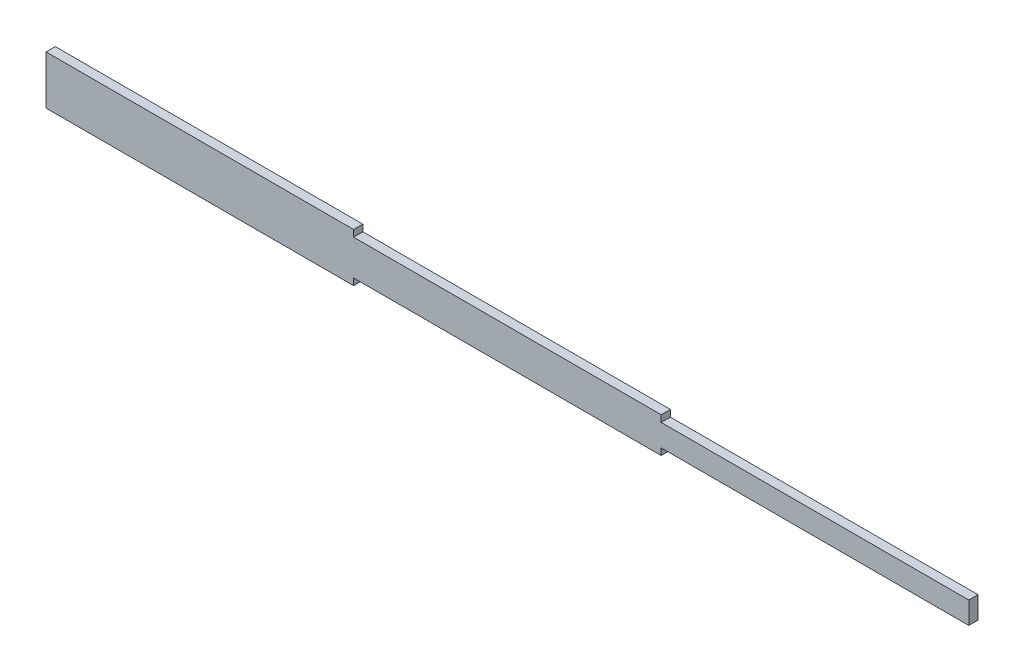
ISO-10303-21;
HEADER;
FILE_DESCRIPTION(('STEP AP214'),'2;1');
FILE_NAME('part.step','',(''),(''),'','','');
FILE_SCHEMA(('AUTOMOTIVE_DESIGN { 1 0 10303 214 1 1 1 1 }'));
ENDSEC;
DATA;
#1=APPLICATION_CONTEXT('core data for automotive mechanical design processes');
#2=APPLICATION_PROTOCOL_DEFINITION('international standard','automotive_design',2000,#1);
#3=PRODUCT_CONTEXT('',#1,'mechanical');
#4=PRODUCT('Part','Part','',(#3));
#5=PRODUCT_RELATED_PRODUCT_CATEGORY('part','',(#4));
#6=PRODUCT_DEFINITION_FORMATION('','',#4);
#7=PRODUCT_DEFINITION_CONTEXT('part definition',#1,'design');
#8=PRODUCT_DEFINITION('design','',#6,#7);
#9=PRODUCT_DEFINITION_SHAPE('','',#8);
#10=(LENGTH_UNIT() NAMED_UNIT(*) SI_UNIT(.MILLI.,.METRE.));
#11=(NAMED_UNIT(*) PLANE_ANGLE_UNIT() SI_UNIT($,.RADIAN.));
#12=(NAMED_UNIT(*) SI_UNIT($,.STERADIAN.) SOLID_ANGLE_UNIT());
#13=UNCERTAINTY_MEASURE_WITH_UNIT(LENGTH_MEASURE(1.E-05),#10,'distance_accuracy_value','');
#14=(GEOMETRIC_REPRESENTATION_CONTEXT(3) GLOBAL_UNCERTAINTY_ASSIGNED_CONTEXT((#13)) GLOBAL_UNIT_ASSIGNED_CONTEXT((#10,
#11,#12)) REPRESENTATION_CONTEXT('',''));
#15=CARTESIAN_POINT('',(0.,0.,0.));
#16=DIRECTION('',(0.,0.,1.));
#17=DIRECTION('',(1.,0.,0.));
#18=AXIS2_PLACEMENT_3D('',#15,#16,#17);
#19=CARTESIAN_POINT('',(1996.,0.,0.));
#20=DIRECTION('',(-1.,0.,0.));
#21=DIRECTION('',(0.,0.,1.));
#22=AXIS2_PLACEMENT_3D('',#19,#20,#21);
#23=PLANE('',#22);
#24=DIRECTION('',(0.,0.,-1.));
#25=VECTOR('',#24,1.);
#26=CARTESIAN_POINT('',(1996.,33.825,-13.));
#27=LINE('',#26,#25);
#28=CARTESIAN_POINT('',(1996.,33.825,13.));
#29=VERTEX_POINT('',#28);
#30=CARTESIAN_POINT('',(1996.,33.825,-13.));
#31=VERTEX_POINT('',#30);
#32=EDGE_CURVE('E236',#29,#31,#27,.T.);
#33=ORIENTED_EDGE('',*,*,#32,.F.);
#34=DIRECTION('',(0.,1.,0.));
#35=VECTOR('',#34,1.);
#36=CARTESIAN_POINT('',(1996.,-55.475,13.));
#37=LINE('',#36,#35);
#38=CARTESIAN_POINT('',(1996.,55.475,13.));
#39=VERTEX_POINT('',#38);
#40=EDGE_CURVE('E214',#29,#39,#37,.T.);
#41=ORIENTED_EDGE('',*,*,#40,.T.);
#42=DIRECTION('',(0.,0.,-1.));
#43=VECTOR('',#42,1.);
#44=CARTESIAN_POINT('',(1996.,55.475,13.));
#45=LINE('',#44,#43);
#46=CARTESIAN_POINT('',(1996.,55.475,-13.));
#47=VERTEX_POINT('',#46);
#48=EDGE_CURVE('E266',#39,#47,#45,.T.);
#49=ORIENTED_EDGE('',*,*,#48,.T.);
#50=DIRECTION('',(0.,-1.,0.));
#51=VECTOR('',#50,1.);
#52=CARTESIAN_POINT('',(1996.,-55.475,-13.));
#53=LINE('',#52,#51);
#54=EDGE_CURVE('E253',#47,#31,#53,.T.);
#55=ORIENTED_EDGE('',*,*,#54,.T.);
#56=EDGE_LOOP('',(#33,#41,#49,#55));
#57=FACE_BOUND('',#56,.T.);
#58=ADVANCED_FACE('F43',(#57),#23,.T.);
#59=CARTESIAN_POINT('',(998.,0.,0.));
#60=DIRECTION('',(1.,0.,0.));
#61=DIRECTION('',(0.,0.,-1.));
#62=AXIS2_PLACEMENT_3D('',#59,#60,#61);
#63=PLANE('',#62);
#64=DIRECTION('',(0.,0.,1.));
#65=VECTOR('',#64,1.);
#66=CARTESIAN_POINT('',(998.,-55.475,13.));
#67=LINE('',#66,#65);
#68=CARTESIAN_POINT('',(998.,-55.475,-13.));
#69=VERTEX_POINT('',#68);
#70=CARTESIAN_POINT('',(998.,-55.475,13.));
#71=VERTEX_POINT('',#70);
#72=EDGE_CURVE('E248',#69,#71,#67,.T.);
#73=ORIENTED_EDGE('',*,*,#72,.F.);
#74=DIRECTION('',(0.,-1.,0.));
#75=VECTOR('',#74,1.);
#76=CARTESIAN_POINT('',(998.,-77.125,-13.));
#77=LINE('',#76,#75);
#78=CARTESIAN_POINT('',(998.,-77.125,-13.));
#79=VERTEX_POINT('',#78);
#80=EDGE_CURVE('E297',#69,#79,#77,.T.);
#81=ORIENTED_EDGE('',*,*,#80,.T.);
#82=DIRECTION('',(0.,0.,1.));
#83=VECTOR('',#82,1.);
#84=CARTESIAN_POINT('',(998.,-77.125,-13.));
#85=LINE('',#84,#83);
#86=CARTESIAN_POINT('',(998.,-77.125,13.));
#87=VERTEX_POINT('',#86);
#88=EDGE_CURVE('E302',#79,#87,#85,.T.);
#89=ORIENTED_EDGE('',*,*,#88,.T.);
#90=DIRECTION('',(0.,1.,0.));
#91=VECTOR('',#90,1.);
#92=CARTESIAN_POINT('',(998.,-77.125,13.));
#93=LINE('',#92,#91);
#94=EDGE_CURVE('E288',#87,#71,#93,.T.);
#95=ORIENTED_EDGE('',*,*,#94,.T.);
#96=EDGE_LOOP('',(#73,#81,#89,#95));
#97=FACE_BOUND('',#96,.T.);
#98=ADVANCED_FACE('F507',(#97),#63,.F.);
#99=DIRECTION('',(0.,0.,-1.));
#100=VECTOR('',#99,1.);
#101=CARTESIAN_POINT('',(998.,55.475,13.));
#102=LINE('',#101,#100);
#103=CARTESIAN_POINT('',(998.,55.475,13.));
#104=VERTEX_POINT('',#103);
#105=CARTESIAN_POINT('',(998.,55.475,-13.));
#106=VERTEX_POINT('',#105);
#107=EDGE_CURVE('E274',#104,#106,#102,.T.);
#108=ORIENTED_EDGE('',*,*,#107,.F.);
#109=CARTESIAN_POINT('',(998.,77.125,13.));
#110=VERTEX_POINT('',#109);
#111=EDGE_CURVE('E293',#104,#110,#93,.T.);
#112=ORIENTED_EDGE('',*,*,#111,.T.);
#113=DIRECTION('',(0.,0.,-1.));
#114=VECTOR('',#113,1.);
#115=CARTESIAN_POINT('',(998.,77.125,-13.));
#116=LINE('',#115,#114);
#117=CARTESIAN_POINT('',(998.,77.125,-13.));
#118=VERTEX_POINT('',#117);
#119=EDGE_CURVE('E292',#110,#118,#116,.T.);
#120=ORIENTED_EDGE('',*,*,#119,.T.);
#121=EDGE_CURVE('E298',#118,#106,#77,.T.);
#122=ORIENTED_EDGE('',*,*,#121,.T.);
#123=EDGE_LOOP('',(#108,#112,#120,#122));
#124=FACE_BOUND('',#123,.T.);
#125=ADVANCED_FACE('F512',(#124),#63,.F.);
#126=CARTESIAN_POINT('',(2000.,0.,0.));
#127=DIRECTION('',(-1.,0.,0.));
#128=DIRECTION('',(0.,0.,1.));
#129=AXIS2_PLACEMENT_3D('',#126,#127,#128);
#130=PLANE('',#129);
#131=DIRECTION('',(0.,0.,-1.));
#132=VECTOR('',#131,1.);
#133=CARTESIAN_POINT('',(2000.,-35.825,15.));
#134=LINE('',#133,#132);
#135=CARTESIAN_POINT('',(2000.,-35.825,15.));
#136=VERTEX_POINT('',#135);
#137=CARTESIAN_POINT('',(2000.,-35.825,-15.));
#138=VERTEX_POINT('',#137);
#139=EDGE_CURVE('E339',#136,#138,#134,.T.);
#140=ORIENTED_EDGE('',*,*,#139,.F.);
#141=DIRECTION('',(0.,-1.,0.));
#142=VECTOR('',#141,1.);
#143=CARTESIAN_POINT('',(2000.,-57.475,15.));
#144=LINE('',#143,#142);
#145=CARTESIAN_POINT('',(2000.,-57.475,15.));
#146=VERTEX_POINT('',#145);
#147=EDGE_CURVE('E378',#136,#146,#144,.T.);
#148=ORIENTED_EDGE('',*,*,#147,.T.);
#149=DIRECTION('',(0.,0.,-1.));
#150=VECTOR('',#149,1.);
#151=CARTESIAN_POINT('',(2000.,-57.475,15.));
#152=LINE('',#151,#150);
#153=CARTESIAN_POINT('',(2000.,-57.475,-15.));
#154=VERTEX_POINT('',#153);
#155=EDGE_CURVE('E382',#146,#154,#152,.T.);
#156=ORIENTED_EDGE('',*,*,#155,.T.);
#157=DIRECTION('',(0.,1.,0.));
#158=VECTOR('',#157,1.);
#159=CARTESIAN_POINT('',(2000.,-57.475,-15.));
#160=LINE('',#159,#158);
#161=EDGE_CURVE('E371',#154,#138,#160,.T.);
#162=ORIENTED_EDGE('',*,*,#161,.T.);
#163=EDGE_LOOP('',(#140,#148,#156,#162));
#164=FACE_BOUND('',#163,.T.);
#165=ADVANCED_FACE('F545',(#164),#130,.F.);
#166=DIRECTION('',(0.,0.,1.));
#167=VECTOR('',#166,1.);
#168=CARTESIAN_POINT('',(2000.,35.825,15.));
#169=LINE('',#168,#167);
#170=CARTESIAN_POINT('',(2000.,35.825,-15.));
#171=VERTEX_POINT('',#170);
#172=CARTESIAN_POINT('',(2000.,35.825,15.));
#173=VERTEX_POINT('',#172);
#174=EDGE_CURVE('E324',#171,#173,#169,.T.);
#175=ORIENTED_EDGE('',*,*,#174,.F.);
#176=CARTESIAN_POINT('',(2000.,57.475,-15.));
#177=VERTEX_POINT('',#176);
#178=EDGE_CURVE('E375',#171,#177,#160,.T.);
#179=ORIENTED_EDGE('',*,*,#178,.T.);
#180=DIRECTION('',(0.,0.,1.));
#181=VECTOR('',#180,1.);
#182=CARTESIAN_POINT('',(2000.,57.475,15.));
#183=LINE('',#182,#181);
#184=CARTESIAN_POINT('',(2000.,57.475,15.));
#185=VERTEX_POINT('',#184);
#186=EDGE_CURVE('E374',#177,#185,#183,.T.);
#187=ORIENTED_EDGE('',*,*,#186,.T.);
#188=EDGE_CURVE('E379',#185,#173,#144,.T.);
#189=ORIENTED_EDGE('',*,*,#188,.T.);
#190=EDGE_LOOP('',(#175,#179,#187,#189));
#191=FACE_BOUND('',#190,.T.);
#192=ADVANCED_FACE('F548',(#191),#130,.F.);
#193=CARTESIAN_POINT('',(1000.,0.,0.));
#194=DIRECTION('',(-1.,0.,0.));
#195=DIRECTION('',(0.,0.,1.));
#196=AXIS2_PLACEMENT_3D('',#193,#194,#195);
#197=PLANE('',#196);
#198=DIRECTION('',(0.,0.,-1.));
#199=VECTOR('',#198,1.);
#200=CARTESIAN_POINT('',(1000.,-57.475,15.));
#201=LINE('',#200,#199);
#202=CARTESIAN_POINT('',(1000.,-57.475,15.));
#203=VERTEX_POINT('',#202);
#204=CARTESIAN_POINT('',(1000.,-57.475,-15.));
#205=VERTEX_POINT('',#204);
#206=EDGE_CURVE('E389',#203,#205,#201,.T.);
#207=ORIENTED_EDGE('',*,*,#206,.F.);
#208=DIRECTION('',(0.,-1.,0.));
#209=VECTOR('',#208,1.);
#210=CARTESIAN_POINT('',(1000.,-79.125,15.));
#211=LINE('',#210,#209);
#212=CARTESIAN_POINT('',(1000.,-79.125,15.));
#213=VERTEX_POINT('',#212);
#214=EDGE_CURVE('E416',#203,#213,#211,.T.);
#215=ORIENTED_EDGE('',*,*,#214,.T.);
#216=DIRECTION('',(0.,0.,-1.));
#217=VECTOR('',#216,1.);
#218=CARTESIAN_POINT('',(1000.,-79.125,15.));
#219=LINE('',#218,#217);
#220=CARTESIAN_POINT('',(1000.,-79.125,-15.));
#221=VERTEX_POINT('',#220);
#222=EDGE_CURVE('E420',#213,#221,#219,.T.);
#223=ORIENTED_EDGE('',*,*,#222,.T.);
#224=DIRECTION('',(0.,1.,0.));
#225=VECTOR('',#224,1.);
#226=CARTESIAN_POINT('',(1000.,-79.125,-15.));
#227=LINE('',#226,#225);
#228=EDGE_CURVE('E409',#221,#205,#227,.T.);
#229=ORIENTED_EDGE('',*,*,#228,.T.);
#230=EDGE_LOOP('',(#207,#215,#223,#229));
#231=FACE_BOUND('',#230,.T.);
#232=ADVANCED_FACE('F466',(#231),#197,.F.);
#233=DIRECTION('',(0.,0.,1.));
#234=VECTOR('',#233,1.);
#235=CARTESIAN_POINT('',(1000.,57.475,15.));
#236=LINE('',#235,#234);
#237=CARTESIAN_POINT('',(1000.,57.475,-15.));
#238=VERTEX_POINT('',#237);
#239=CARTESIAN_POINT('',(1000.,57.475,15.));
#240=VERTEX_POINT('',#239);
#241=EDGE_CURVE('E370',#238,#240,#236,.T.);
#242=ORIENTED_EDGE('',*,*,#241,.F.);
#243=CARTESIAN_POINT('',(1000.,79.125,-15.));
#244=VERTEX_POINT('',#243);
#245=EDGE_CURVE('E413',#238,#244,#227,.T.);
#246=ORIENTED_EDGE('',*,*,#245,.T.);
#247=DIRECTION('',(0.,0.,1.));
#248=VECTOR('',#247,1.);
#249=CARTESIAN_POINT('',(1000.,79.125,15.));
#250=LINE('',#249,#248);
#251=CARTESIAN_POINT('',(1000.,79.125,15.));
#252=VERTEX_POINT('',#251);
#253=EDGE_CURVE('E412',#244,#252,#250,.T.);
#254=ORIENTED_EDGE('',*,*,#253,.T.);
#255=EDGE_CURVE('E417',#252,#240,#211,.T.);
#256=ORIENTED_EDGE('',*,*,#255,.T.);
#257=EDGE_LOOP('',(#242,#246,#254,#256));
#258=FACE_BOUND('',#257,.T.);
#259=ADVANCED_FACE('F558',(#258),#197,.F.);
#260=CARTESIAN_POINT('',(1000.,-79.125,-15.));
#261=DIRECTION('',(0.,0.,1.));
#262=DIRECTION('',(1.,0.,0.));
#263=AXIS2_PLACEMENT_3D('',#260,#261,#262);
#264=PLANE('',#263);
#265=DIRECTION('',(0.,1.,0.));
#266=VECTOR('',#265,1.);
#267=CARTESIAN_POINT('',(0.,-79.125,-15.));
#268=LINE('',#267,#266);
#269=CARTESIAN_POINT('',(0.,-79.125,-15.));
#270=VERTEX_POINT('',#269);
#271=CARTESIAN_POINT('',(0.,79.125,-15.));
#272=VERTEX_POINT('',#271);
#273=EDGE_CURVE('E408',#270,#272,#268,.T.);
#274=ORIENTED_EDGE('',*,*,#273,.T.);
#275=DIRECTION('',(-1.,0.,0.));
#276=VECTOR('',#275,1.);
#277=CARTESIAN_POINT('',(1000.,79.125,-15.));
#278=LINE('',#277,#276);
#279=EDGE_CURVE('E11',#244,#272,#278,.T.);
#280=ORIENTED_EDGE('',*,*,#279,.F.);
#281=ORIENTED_EDGE('',*,*,#245,.F.);
#282=DIRECTION('',(-1.,0.,0.));
#283=VECTOR('',#282,1.);
#284=CARTESIAN_POINT('',(2000.,57.475,-15.));
#285=LINE('',#284,#283);
#286=EDGE_CURVE('E404',#177,#238,#285,.T.);
#287=ORIENTED_EDGE('',*,*,#286,.F.);
#288=ORIENTED_EDGE('',*,*,#178,.F.);
#289=DIRECTION('',(-1.,0.,0.));
#290=VECTOR('',#289,1.);
#291=CARTESIAN_POINT('',(3000.,35.825,-15.));
#292=LINE('',#291,#290);
#293=CARTESIAN_POINT('',(3000.,35.825,-15.));
#294=VERTEX_POINT('',#293);
#295=EDGE_CURVE('E366',#294,#171,#292,.T.);
#296=ORIENTED_EDGE('',*,*,#295,.F.);
#297=DIRECTION('',(0.,1.,0.));
#298=VECTOR('',#297,1.);
#299=CARTESIAN_POINT('',(3000.,-35.825,-15.));
#300=LINE('',#299,#298);
#301=CARTESIAN_POINT('',(3000.,-35.825,-15.));
#302=VERTEX_POINT('',#301);
#303=EDGE_CURVE('E334',#302,#294,#300,.T.);
#304=ORIENTED_EDGE('',*,*,#303,.F.);
#305=DIRECTION('',(-1.,0.,0.));
#306=VECTOR('',#305,1.);
#307=CARTESIAN_POINT('',(3000.,-35.825,-15.));
#308=LINE('',#307,#306);
#309=EDGE_CURVE('E348',#302,#138,#308,.T.);
#310=ORIENTED_EDGE('',*,*,#309,.T.);
#311=ORIENTED_EDGE('',*,*,#161,.F.);
#312=DIRECTION('',(-1.,0.,0.));
#313=VECTOR('',#312,1.);
#314=CARTESIAN_POINT('',(2000.,-57.475,-15.));
#315=LINE('',#314,#313);
#316=EDGE_CURVE('E385',#154,#205,#315,.T.);
#317=ORIENTED_EDGE('',*,*,#316,.T.);
#318=ORIENTED_EDGE('',*,*,#228,.F.);
#319=DIRECTION('',(-1.,0.,0.));
#320=VECTOR('',#319,1.);
#321=CARTESIAN_POINT('',(1000.,-79.125,-15.));
#322=LINE('',#321,#320);
#323=EDGE_CURVE('E423',#221,#270,#322,.T.);
#324=ORIENTED_EDGE('',*,*,#323,.T.);
#325=EDGE_LOOP('',(#274,#280,#281,#287,#288,#296,#304,#310,#311,#317,#318,#324));
#326=FACE_BOUND('',#325,.T.);
#327=ADVANCED_FACE('F45',(#326),#264,.F.);
#328=CARTESIAN_POINT('',(1000.,79.125,15.));
#329=DIRECTION('',(0.,-1.,0.));
#330=DIRECTION('',(0.,0.,-1.));
#331=AXIS2_PLACEMENT_3D('',#328,#329,#330);
#332=PLANE('',#331);
#333=DIRECTION('',(0.,0.,1.));
#334=VECTOR('',#333,1.);
#335=CARTESIAN_POINT('',(0.,79.125,15.));
#336=LINE('',#335,#334);
#337=CARTESIAN_POINT('',(0.,79.125,15.));
#338=VERTEX_POINT('',#337);
#339=EDGE_CURVE('E427',#272,#338,#336,.T.);
#340=ORIENTED_EDGE('',*,*,#339,.T.);
#341=DIRECTION('',(-1.,0.,0.));
#342=VECTOR('',#341,1.);
#343=CARTESIAN_POINT('',(1000.,79.125,15.));
#344=LINE('',#343,#342);
#345=EDGE_CURVE('E52',#252,#338,#344,.T.);
#346=ORIENTED_EDGE('',*,*,#345,.F.);
#347=ORIENTED_EDGE('',*,*,#253,.F.);
#348=ORIENTED_EDGE('',*,*,#279,.T.);
#349=EDGE_LOOP('',(#340,#346,#347,#348));
#350=FACE_BOUND('',#349,.T.);
#351=ADVANCED_FACE('F565',(#350),#332,.F.);
#352=CARTESIAN_POINT('',(1000.,-79.125,15.));
#353=DIRECTION('',(0.,0.,-1.));
#354=DIRECTION('',(-1.,0.,0.));
#355=AXIS2_PLACEMENT_3D('',#352,#353,#354);
#356=PLANE('',#355);
#357=DIRECTION('',(0.,-1.,0.));
#358=VECTOR('',#357,1.);
#359=CARTESIAN_POINT('',(0.,-79.125,15.));
#360=LINE('',#359,#358);
#361=CARTESIAN_POINT('',(0.,-79.125,15.));
#362=VERTEX_POINT('',#361);
#363=EDGE_CURVE('E430',#338,#362,#360,.T.);
#364=ORIENTED_EDGE('',*,*,#363,.T.);
#365=DIRECTION('',(-1.,0.,0.));
#366=VECTOR('',#365,1.);
#367=CARTESIAN_POINT('',(1000.,-79.125,15.));
#368=LINE('',#367,#366);
#369=EDGE_CURVE('E439',#213,#362,#368,.T.);
#370=ORIENTED_EDGE('',*,*,#369,.F.);
#371=ORIENTED_EDGE('',*,*,#214,.F.);
#372=DIRECTION('',(-1.,0.,0.));
#373=VECTOR('',#372,1.);
#374=CARTESIAN_POINT('',(2000.,-57.475,15.));
#375=LINE('',#374,#373);
#376=EDGE_CURVE('E396',#146,#203,#375,.T.);
#377=ORIENTED_EDGE('',*,*,#376,.F.);
#378=ORIENTED_EDGE('',*,*,#147,.F.);
#379=DIRECTION('',(-1.,0.,0.));
#380=VECTOR('',#379,1.);
#381=CARTESIAN_POINT('',(3000.,-35.825,15.));
#382=LINE('',#381,#380);
#383=CARTESIAN_POINT('',(3000.,-35.825,15.));
#384=VERTEX_POINT('',#383);
#385=EDGE_CURVE('E358',#384,#136,#382,.T.);
#386=ORIENTED_EDGE('',*,*,#385,.F.);
#387=DIRECTION('',(0.,-1.,0.));
#388=VECTOR('',#387,1.);
#389=CARTESIAN_POINT('',(3000.,-35.825,15.));
#390=LINE('',#389,#388);
#391=CARTESIAN_POINT('',(3000.,35.825,15.));
#392=VERTEX_POINT('',#391);
#393=EDGE_CURVE('E342',#392,#384,#390,.T.);
#394=ORIENTED_EDGE('',*,*,#393,.F.);
#395=DIRECTION('',(-1.,0.,0.));
#396=VECTOR('',#395,1.);
#397=CARTESIAN_POINT('',(3000.,35.825,15.));
#398=LINE('',#397,#396);
#399=EDGE_CURVE('E362',#392,#173,#398,.T.);
#400=ORIENTED_EDGE('',*,*,#399,.T.);
#401=ORIENTED_EDGE('',*,*,#188,.F.);
#402=DIRECTION('',(-1.,0.,0.));
#403=VECTOR('',#402,1.);
#404=CARTESIAN_POINT('',(2000.,57.475,15.));
#405=LINE('',#404,#403);
#406=EDGE_CURVE('E400',#185,#240,#405,.T.);
#407=ORIENTED_EDGE('',*,*,#406,.T.);
#408=ORIENTED_EDGE('',*,*,#255,.F.);
#409=ORIENTED_EDGE('',*,*,#345,.T.);
#410=EDGE_LOOP('',(#364,#370,#371,#377,#378,#386,#394,#400,#401,#407,#408,#409));
#411=FACE_BOUND('',#410,.T.);
#412=ADVANCED_FACE('F448',(#411),#356,.F.);
#413=CARTESIAN_POINT('',(1000.,-79.125,15.));
#414=DIRECTION('',(0.,1.,0.));
#415=DIRECTION('',(0.,0.,1.));
#416=AXIS2_PLACEMENT_3D('',#413,#414,#415);
#417=PLANE('',#416);
#418=DIRECTION('',(0.,0.,-1.));
#419=VECTOR('',#418,1.);
#420=CARTESIAN_POINT('',(0.,-79.125,15.));
#421=LINE('',#420,#419);
#422=EDGE_CURVE('E433',#362,#270,#421,.T.);
#423=ORIENTED_EDGE('',*,*,#422,.T.);
#424=ORIENTED_EDGE('',*,*,#323,.F.);
#425=ORIENTED_EDGE('',*,*,#222,.F.);
#426=ORIENTED_EDGE('',*,*,#369,.T.);
#427=EDGE_LOOP('',(#423,#424,#425,#426));
#428=FACE_BOUND('',#427,.T.);
#429=ADVANCED_FACE('F458',(#428),#417,.F.);
#430=CARTESIAN_POINT('',(0.,0.,0.));
#431=DIRECTION('',(-1.,0.,0.));
#432=DIRECTION('',(0.,0.,1.));
#433=AXIS2_PLACEMENT_3D('',#430,#431,#432);
#434=PLANE('',#433);
#435=DIRECTION('',(0.,1.,0.));
#436=VECTOR('',#435,1.);
#437=CARTESIAN_POINT('',(0.,-77.125,13.));
#438=LINE('',#437,#436);
#439=CARTESIAN_POINT('',(0.,-77.125,13.));
#440=VERTEX_POINT('',#439);
#441=CARTESIAN_POINT('',(0.,77.125,13.));
#442=VERTEX_POINT('',#441);
#443=EDGE_CURVE('E280',#440,#442,#438,.T.);
#444=ORIENTED_EDGE('',*,*,#443,.F.);
#445=DIRECTION('',(0.,0.,1.));
#446=VECTOR('',#445,1.);
#447=CARTESIAN_POINT('',(0.,-77.125,-13.));
#448=LINE('',#447,#446);
#449=CARTESIAN_POINT('',(0.,-77.125,-13.));
#450=VERTEX_POINT('',#449);
#451=EDGE_CURVE('E317',#450,#440,#448,.T.);
#452=ORIENTED_EDGE('',*,*,#451,.F.);
#453=DIRECTION('',(0.,-1.,0.));
#454=VECTOR('',#453,1.);
#455=CARTESIAN_POINT('',(0.,-77.125,-13.));
#456=LINE('',#455,#454);
#457=CARTESIAN_POINT('',(0.,77.125,-13.));
#458=VERTEX_POINT('',#457);
#459=EDGE_CURVE('E313',#458,#450,#456,.T.);
#460=ORIENTED_EDGE('',*,*,#459,.F.);
#461=DIRECTION('',(0.,0.,-1.));
#462=VECTOR('',#461,1.);
#463=CARTESIAN_POINT('',(0.,77.125,-13.));
#464=LINE('',#463,#462);
#465=EDGE_CURVE('E309',#442,#458,#464,.T.);
#466=ORIENTED_EDGE('',*,*,#465,.F.);
#467=EDGE_LOOP('',(#444,#452,#460,#466));
#468=FACE_BOUND('',#467,.T.);
#469=ORIENTED_EDGE('',*,*,#273,.F.);
#470=ORIENTED_EDGE('',*,*,#422,.F.);
#471=ORIENTED_EDGE('',*,*,#363,.F.);
#472=ORIENTED_EDGE('',*,*,#339,.F.);
#473=EDGE_LOOP('',(#469,#470,#471,#472));
#474=FACE_BOUND('',#473,.T.);
#475=ADVANCED_FACE('F455',(#468,#474),#434,.T.);
#476=CARTESIAN_POINT('',(2000.,57.475,15.));
#477=DIRECTION('',(0.,-1.,0.));
#478=DIRECTION('',(0.,0.,-1.));
#479=AXIS2_PLACEMENT_3D('',#476,#477,#478);
#480=PLANE('',#479);
#481=ORIENTED_EDGE('',*,*,#241,.T.);
#482=ORIENTED_EDGE('',*,*,#406,.F.);
#483=ORIENTED_EDGE('',*,*,#186,.F.);
#484=ORIENTED_EDGE('',*,*,#286,.T.);
#485=EDGE_LOOP('',(#481,#482,#483,#484));
#486=FACE_BOUND('',#485,.T.);
#487=ADVANCED_FACE('F552',(#486),#480,.F.);
#488=CARTESIAN_POINT('',(2000.,-57.475,15.));
#489=DIRECTION('',(0.,1.,0.));
#490=DIRECTION('',(0.,0.,1.));
#491=AXIS2_PLACEMENT_3D('',#488,#489,#490);
#492=PLANE('',#491);
#493=ORIENTED_EDGE('',*,*,#206,.T.);
#494=ORIENTED_EDGE('',*,*,#316,.F.);
#495=ORIENTED_EDGE('',*,*,#155,.F.);
#496=ORIENTED_EDGE('',*,*,#376,.T.);
#497=EDGE_LOOP('',(#493,#494,#495,#496));
#498=FACE_BOUND('',#497,.T.);
#499=ADVANCED_FACE('F469',(#498),#492,.F.);
#500=CARTESIAN_POINT('',(3000.,35.825,15.));
#501=DIRECTION('',(0.,-1.,0.));
#502=DIRECTION('',(0.,0.,-1.));
#503=AXIS2_PLACEMENT_3D('',#500,#501,#502);
#504=PLANE('',#503);
#505=ORIENTED_EDGE('',*,*,#174,.T.);
#506=ORIENTED_EDGE('',*,*,#399,.F.);
#507=DIRECTION('',(0.,0.,1.));
#508=VECTOR('',#507,1.);
#509=CARTESIAN_POINT('',(3000.,35.825,15.));
#510=LINE('',#509,#508);
#511=EDGE_CURVE('E338',#294,#392,#510,.T.);
#512=ORIENTED_EDGE('',*,*,#511,.F.);
#513=ORIENTED_EDGE('',*,*,#295,.T.);
#514=EDGE_LOOP('',(#505,#506,#512,#513));
#515=FACE_BOUND('',#514,.T.);
#516=ADVANCED_FACE('F540',(#515),#504,.F.);
#517=CARTESIAN_POINT('',(3000.,-35.825,15.));
#518=DIRECTION('',(0.,1.,0.));
#519=DIRECTION('',(0.,0.,1.));
#520=AXIS2_PLACEMENT_3D('',#517,#518,#519);
#521=PLANE('',#520);
#522=ORIENTED_EDGE('',*,*,#139,.T.);
#523=ORIENTED_EDGE('',*,*,#309,.F.);
#524=DIRECTION('',(0.,0.,-1.));
#525=VECTOR('',#524,1.);
#526=CARTESIAN_POINT('',(3000.,-35.825,15.));
#527=LINE('',#526,#525);
#528=EDGE_CURVE('E345',#384,#302,#527,.T.);
#529=ORIENTED_EDGE('',*,*,#528,.F.);
#530=ORIENTED_EDGE('',*,*,#385,.T.);
#531=EDGE_LOOP('',(#522,#523,#529,#530));
#532=FACE_BOUND('',#531,.T.);
#533=ADVANCED_FACE('F536',(#532),#521,.F.);
#534=CARTESIAN_POINT('',(3000.,0.,0.));
#535=DIRECTION('',(-1.,0.,0.));
#536=DIRECTION('',(0.,0.,1.));
#537=AXIS2_PLACEMENT_3D('',#534,#535,#536);
#538=PLANE('',#537);
#539=ORIENTED_EDGE('',*,*,#303,.T.);
#540=ORIENTED_EDGE('',*,*,#511,.T.);
#541=ORIENTED_EDGE('',*,*,#393,.T.);
#542=ORIENTED_EDGE('',*,*,#528,.T.);
#543=EDGE_LOOP('',(#539,#540,#541,#542));
#544=FACE_BOUND('',#543,.T.);
#545=ADVANCED_FACE('F533',(#544),#538,.F.);
#546=CARTESIAN_POINT('',(998.,-77.125,13.));
#547=DIRECTION('',(0.,0.,1.));
#548=DIRECTION('',(1.,0.,0.));
#549=AXIS2_PLACEMENT_3D('',#546,#547,#548);
#550=PLANE('',#549);
#551=ORIENTED_EDGE('',*,*,#443,.T.);
#552=DIRECTION('',(-1.,0.,0.));
#553=VECTOR('',#552,1.);
#554=CARTESIAN_POINT('',(998.,77.125,13.));
#555=LINE('',#554,#553);
#556=EDGE_CURVE('E306',#110,#442,#555,.T.);
#557=ORIENTED_EDGE('',*,*,#556,.F.);
#558=ORIENTED_EDGE('',*,*,#111,.F.);
#559=DIRECTION('',(-1.,0.,0.));
#560=VECTOR('',#559,1.);
#561=CARTESIAN_POINT('',(1996.,55.475,13.));
#562=LINE('',#561,#560);
#563=EDGE_CURVE('E67',#39,#104,#562,.T.);
#564=ORIENTED_EDGE('',*,*,#563,.F.);
#565=ORIENTED_EDGE('',*,*,#40,.F.);
#566=DIRECTION('',(-1.,0.,0.));
#567=VECTOR('',#566,1.);
#568=CARTESIAN_POINT('',(2994.,33.825,13.));
#569=LINE('',#568,#567);
#570=CARTESIAN_POINT('',(2994.,33.825,13.));
#571=VERTEX_POINT('',#570);
#572=EDGE_CURVE('E208',#571,#29,#569,.T.);
#573=ORIENTED_EDGE('',*,*,#572,.F.);
#574=DIRECTION('',(0.,1.,0.));
#575=VECTOR('',#574,1.);
#576=CARTESIAN_POINT('',(2994.,-33.825,13.));
#577=LINE('',#576,#575);
#578=CARTESIAN_POINT('',(2994.,-33.825,13.));
#579=VERTEX_POINT('',#578);
#580=EDGE_CURVE('E212',#579,#571,#577,.T.);
#581=ORIENTED_EDGE('',*,*,#580,.F.);
#582=DIRECTION('',(-1.,0.,0.));
#583=VECTOR('',#582,1.);
#584=CARTESIAN_POINT('',(2994.,-33.825,13.));
#585=LINE('',#584,#583);
#586=CARTESIAN_POINT('',(1996.,-33.825,13.));
#587=VERTEX_POINT('',#586);
#588=EDGE_CURVE('E245',#579,#587,#585,.T.);
#589=ORIENTED_EDGE('',*,*,#588,.T.);
#590=CARTESIAN_POINT('',(1996.,-55.475,13.));
#591=VERTEX_POINT('',#590);
#592=EDGE_CURVE('E262',#591,#587,#37,.T.);
#593=ORIENTED_EDGE('',*,*,#592,.F.);
#594=DIRECTION('',(-1.,0.,0.));
#595=VECTOR('',#594,1.);
#596=CARTESIAN_POINT('',(1996.,-55.475,13.));
#597=LINE('',#596,#595);
#598=EDGE_CURVE('E283',#591,#71,#597,.T.);
#599=ORIENTED_EDGE('',*,*,#598,.T.);
#600=ORIENTED_EDGE('',*,*,#94,.F.);
#601=DIRECTION('',(-1.,0.,0.));
#602=VECTOR('',#601,1.);
#603=CARTESIAN_POINT('',(998.,-77.125,13.));
#604=LINE('',#603,#602);
#605=EDGE_CURVE('E321',#87,#440,#604,.T.);
#606=ORIENTED_EDGE('',*,*,#605,.T.);
#607=EDGE_LOOP('',(#551,#557,#558,#564,#565,#573,#581,#589,#593,#599,#600,#606));
#608=FACE_BOUND('',#607,.T.);
#609=ADVANCED_FACE('F210',(#608),#550,.F.);
#610=CARTESIAN_POINT('',(998.,-77.125,-13.));
#611=DIRECTION('',(0.,-1.,0.));
#612=DIRECTION('',(0.,0.,-1.));
#613=AXIS2_PLACEMENT_3D('',#610,#611,#612);
#614=PLANE('',#613);
#615=ORIENTED_EDGE('',*,*,#451,.T.);
#616=ORIENTED_EDGE('',*,*,#605,.F.);
#617=ORIENTED_EDGE('',*,*,#88,.F.);
#618=DIRECTION('',(-1.,0.,0.));
#619=VECTOR('',#618,1.);
#620=CARTESIAN_POINT('',(998.,-77.125,-13.));
#621=LINE('',#620,#619);
#622=EDGE_CURVE('E325',#79,#450,#621,.T.);
#623=ORIENTED_EDGE('',*,*,#622,.T.);
#624=EDGE_LOOP('',(#615,#616,#617,#623));
#625=FACE_BOUND('',#624,.T.);
#626=ADVANCED_FACE('F522',(#625),#614,.F.);
#627=CARTESIAN_POINT('',(998.,-77.125,-13.));
#628=DIRECTION('',(0.,0.,-1.));
#629=DIRECTION('',(-1.,0.,0.));
#630=AXIS2_PLACEMENT_3D('',#627,#628,#629);
#631=PLANE('',#630);
#632=ORIENTED_EDGE('',*,*,#459,.T.);
#633=ORIENTED_EDGE('',*,*,#622,.F.);
#634=ORIENTED_EDGE('',*,*,#80,.F.);
#635=DIRECTION('',(-1.,0.,0.));
#636=VECTOR('',#635,1.);
#637=CARTESIAN_POINT('',(1996.,-55.475,-13.));
#638=LINE('',#637,#636);
#639=CARTESIAN_POINT('',(1996.,-55.475,-13.));
#640=VERTEX_POINT('',#639);
#641=EDGE_CURVE('E270',#640,#69,#638,.T.);
#642=ORIENTED_EDGE('',*,*,#641,.F.);
#643=CARTESIAN_POINT('',(1996.,-33.825,-13.));
#644=VERTEX_POINT('',#643);
#645=EDGE_CURVE('E258',#644,#640,#53,.T.);
#646=ORIENTED_EDGE('',*,*,#645,.F.);
#647=DIRECTION('',(-1.,0.,0.));
#648=VECTOR('',#647,1.);
#649=CARTESIAN_POINT('',(2994.,-33.825,-13.));
#650=LINE('',#649,#648);
#651=CARTESIAN_POINT('',(2994.,-33.825,-13.));
#652=VERTEX_POINT('',#651);
#653=EDGE_CURVE('E59',#652,#644,#650,.T.);
#654=ORIENTED_EDGE('',*,*,#653,.F.);
#655=DIRECTION('',(0.,-1.,0.));
#656=VECTOR('',#655,1.);
#657=CARTESIAN_POINT('',(2994.,-33.825,-13.));
#658=LINE('',#657,#656);
#659=CARTESIAN_POINT('',(2994.,33.825,-13.));
#660=VERTEX_POINT('',#659);
#661=EDGE_CURVE('E229',#660,#652,#658,.T.);
#662=ORIENTED_EDGE('',*,*,#661,.F.);
#663=DIRECTION('',(-1.,0.,0.));
#664=VECTOR('',#663,1.);
#665=CARTESIAN_POINT('',(2994.,33.825,-13.));
#666=LINE('',#665,#664);
#667=EDGE_CURVE('E219',#660,#31,#666,.T.);
#668=ORIENTED_EDGE('',*,*,#667,.T.);
#669=ORIENTED_EDGE('',*,*,#54,.F.);
#670=DIRECTION('',(-1.,0.,0.));
#671=VECTOR('',#670,1.);
#672=CARTESIAN_POINT('',(1996.,55.475,-13.));
#673=LINE('',#672,#671);
#674=EDGE_CURVE('E277',#47,#106,#673,.T.);
#675=ORIENTED_EDGE('',*,*,#674,.T.);
#676=ORIENTED_EDGE('',*,*,#121,.F.);
#677=DIRECTION('',(-1.,0.,0.));
#678=VECTOR('',#677,1.);
#679=CARTESIAN_POINT('',(998.,77.125,-13.));
#680=LINE('',#679,#678);
#681=EDGE_CURVE('E328',#118,#458,#680,.T.);
#682=ORIENTED_EDGE('',*,*,#681,.T.);
#683=EDGE_LOOP('',(#632,#633,#634,#642,#646,#654,#662,#668,#669,#675,#676,#682));
#684=FACE_BOUND('',#683,.T.);
#685=ADVANCED_FACE('F489',(#684),#631,.F.);
#686=CARTESIAN_POINT('',(998.,77.125,-13.));
#687=DIRECTION('',(0.,1.,0.));
#688=DIRECTION('',(0.,0.,1.));
#689=AXIS2_PLACEMENT_3D('',#686,#687,#688);
#690=PLANE('',#689);
#691=ORIENTED_EDGE('',*,*,#465,.T.);
#692=ORIENTED_EDGE('',*,*,#681,.F.);
#693=ORIENTED_EDGE('',*,*,#119,.F.);
#694=ORIENTED_EDGE('',*,*,#556,.T.);
#695=EDGE_LOOP('',(#691,#692,#693,#694));
#696=FACE_BOUND('',#695,.T.);
#697=ADVANCED_FACE('F519',(#696),#690,.F.);
#698=CARTESIAN_POINT('',(1996.,55.475,13.));
#699=DIRECTION('',(0.,1.,0.));
#700=DIRECTION('',(0.,0.,1.));
#701=AXIS2_PLACEMENT_3D('',#698,#699,#700);
#702=PLANE('',#701);
#703=ORIENTED_EDGE('',*,*,#107,.T.);
#704=ORIENTED_EDGE('',*,*,#674,.F.);
#705=ORIENTED_EDGE('',*,*,#48,.F.);
#706=ORIENTED_EDGE('',*,*,#563,.T.);
#707=EDGE_LOOP('',(#703,#704,#705,#706));
#708=FACE_BOUND('',#707,.T.);
#709=ADVANCED_FACE('F516',(#708),#702,.F.);
#710=CARTESIAN_POINT('',(1996.,-55.475,13.));
#711=DIRECTION('',(0.,-1.,0.));
#712=DIRECTION('',(0.,0.,-1.));
#713=AXIS2_PLACEMENT_3D('',#710,#711,#712);
#714=PLANE('',#713);
#715=ORIENTED_EDGE('',*,*,#72,.T.);
#716=ORIENTED_EDGE('',*,*,#598,.F.);
#717=DIRECTION('',(0.,0.,1.));
#718=VECTOR('',#717,1.);
#719=CARTESIAN_POINT('',(1996.,-55.475,13.));
#720=LINE('',#719,#718);
#721=EDGE_CURVE('E257',#640,#591,#720,.T.);
#722=ORIENTED_EDGE('',*,*,#721,.F.);
#723=ORIENTED_EDGE('',*,*,#641,.T.);
#724=EDGE_LOOP('',(#715,#716,#722,#723));
#725=FACE_BOUND('',#724,.T.);
#726=ADVANCED_FACE('F493',(#725),#714,.F.);
#727=DIRECTION('',(0.,0.,1.));
#728=VECTOR('',#727,1.);
#729=CARTESIAN_POINT('',(1996.,-33.825,-13.));
#730=LINE('',#729,#728);
#731=EDGE_CURVE('E233',#644,#587,#730,.T.);
#732=ORIENTED_EDGE('',*,*,#731,.F.);
#733=ORIENTED_EDGE('',*,*,#645,.T.);
#734=ORIENTED_EDGE('',*,*,#721,.T.);
#735=ORIENTED_EDGE('',*,*,#592,.T.);
#736=EDGE_LOOP('',(#732,#733,#734,#735));
#737=FACE_BOUND('',#736,.T.);
#738=ADVANCED_FACE('F485',(#737),#23,.T.);
#739=CARTESIAN_POINT('',(2994.,-33.825,-13.));
#740=DIRECTION('',(0.,-1.,0.));
#741=DIRECTION('',(0.,0.,-1.));
#742=AXIS2_PLACEMENT_3D('',#739,#740,#741);
#743=PLANE('',#742);
#744=ORIENTED_EDGE('',*,*,#731,.T.);
#745=ORIENTED_EDGE('',*,*,#588,.F.);
#746=DIRECTION('',(0.,0.,1.));
#747=VECTOR('',#746,1.);
#748=CARTESIAN_POINT('',(2994.,-33.825,-13.));
#749=LINE('',#748,#747);
#750=EDGE_CURVE('E220',#652,#579,#749,.T.);
#751=ORIENTED_EDGE('',*,*,#750,.F.);
#752=ORIENTED_EDGE('',*,*,#653,.T.);
#753=EDGE_LOOP('',(#744,#745,#751,#752));
#754=FACE_BOUND('',#753,.T.);
#755=ADVANCED_FACE('F496',(#754),#743,.F.);
#756=CARTESIAN_POINT('',(2994.,33.825,-13.));
#757=DIRECTION('',(0.,1.,0.));
#758=DIRECTION('',(0.,0.,1.));
#759=AXIS2_PLACEMENT_3D('',#756,#757,#758);
#760=PLANE('',#759);
#761=ORIENTED_EDGE('',*,*,#32,.T.);
#762=ORIENTED_EDGE('',*,*,#667,.F.);
#763=DIRECTION('',(0.,0.,-1.));
#764=VECTOR('',#763,1.);
#765=CARTESIAN_POINT('',(2994.,33.825,-13.));
#766=LINE('',#765,#764);
#767=EDGE_CURVE('E223',#571,#660,#766,.T.);
#768=ORIENTED_EDGE('',*,*,#767,.F.);
#769=ORIENTED_EDGE('',*,*,#572,.T.);
#770=EDGE_LOOP('',(#761,#762,#768,#769));
#771=FACE_BOUND('',#770,.T.);
#772=ADVANCED_FACE('F224',(#771),#760,.F.);
#773=CARTESIAN_POINT('',(2994.,0.,0.));
#774=DIRECTION('',(1.,0.,0.));
#775=DIRECTION('',(0.,0.,-1.));
#776=AXIS2_PLACEMENT_3D('',#773,#774,#775);
#777=PLANE('',#776);
#778=ORIENTED_EDGE('',*,*,#580,.T.);
#779=ORIENTED_EDGE('',*,*,#767,.T.);
#780=ORIENTED_EDGE('',*,*,#661,.T.);
#781=ORIENTED_EDGE('',*,*,#750,.T.);
#782=EDGE_LOOP('',(#778,#779,#780,#781));
#783=FACE_BOUND('',#782,.T.);
#784=ADVANCED_FACE('F231',(#783),#777,.F.);
#785=CLOSED_SHELL('',(#58,#98,#125,#165,#192,#232,#259,#327,#351,#412,#429,#475,#487,#499,#516,
#533,#545,#609,#626,#685,#697,#709,#726,#738,#755,#772,#784));
#786=MANIFOLD_SOLID_BREP('B2',#785);
#787=ADVANCED_BREP_SHAPE_REPRESENTATION('',(#18,#786),#14);
#788=SHAPE_DEFINITION_REPRESENTATION(#9,#787);
ENDSEC;
END-ISO-10303-21;
